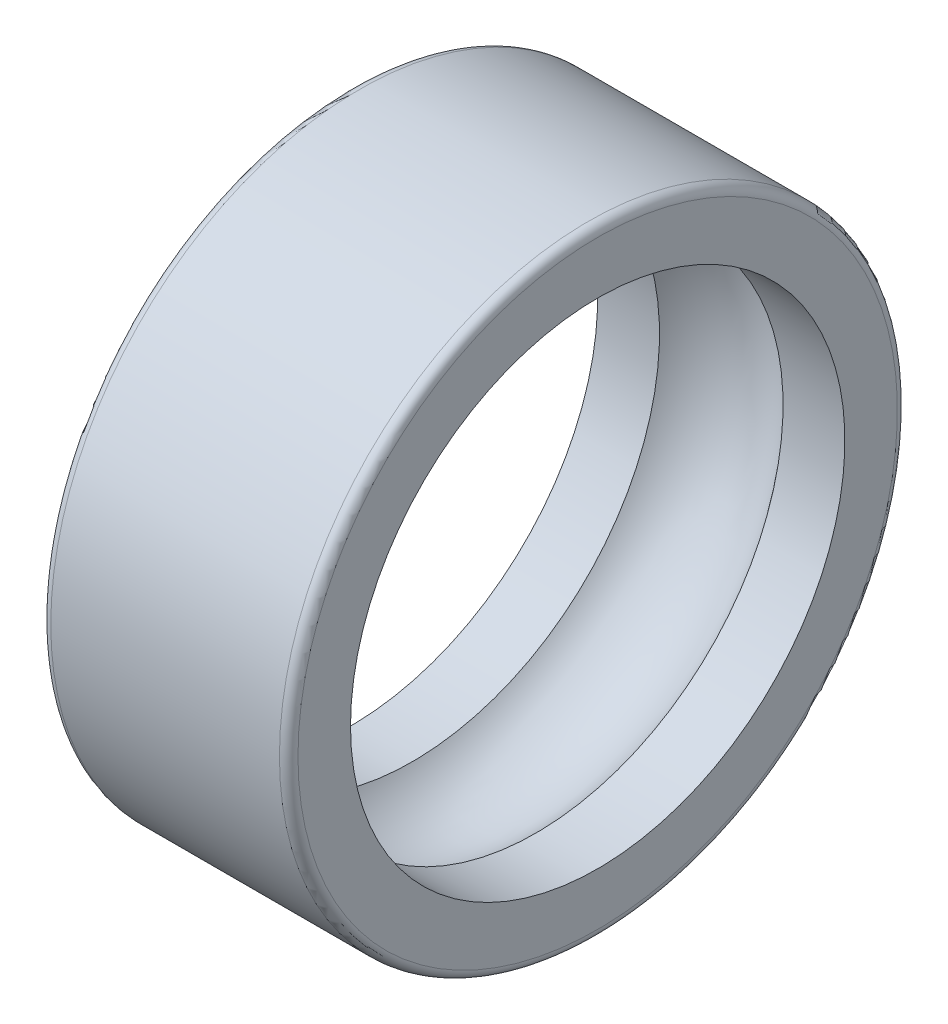
ISO-10303-21;
HEADER;
FILE_DESCRIPTION(('STEP AP214'),'2;1');
FILE_NAME('part.step','',(''),(''),'','','');
FILE_SCHEMA(('AUTOMOTIVE_DESIGN { 1 0 10303 214 1 1 1 1 }'));
ENDSEC;
DATA;
#1=APPLICATION_CONTEXT('core data for automotive mechanical design processes');
#2=APPLICATION_PROTOCOL_DEFINITION('international standard','automotive_design',2000,#1);
#3=PRODUCT_CONTEXT('',#1,'mechanical');
#4=PRODUCT('Part','Part','',(#3));
#5=PRODUCT_RELATED_PRODUCT_CATEGORY('part','',(#4));
#6=PRODUCT_DEFINITION_FORMATION('','',#4);
#7=PRODUCT_DEFINITION_CONTEXT('part definition',#1,'design');
#8=PRODUCT_DEFINITION('design','',#6,#7);
#9=PRODUCT_DEFINITION_SHAPE('','',#8);
#10=(LENGTH_UNIT() NAMED_UNIT(*) SI_UNIT(.MILLI.,.METRE.));
#11=(NAMED_UNIT(*) PLANE_ANGLE_UNIT() SI_UNIT($,.RADIAN.));
#12=(NAMED_UNIT(*) SI_UNIT($,.STERADIAN.) SOLID_ANGLE_UNIT());
#13=UNCERTAINTY_MEASURE_WITH_UNIT(LENGTH_MEASURE(1.E-05),#10,'distance_accuracy_value','');
#14=(GEOMETRIC_REPRESENTATION_CONTEXT(3) GLOBAL_UNCERTAINTY_ASSIGNED_CONTEXT((#13)) GLOBAL_UNIT_ASSIGNED_CONTEXT((#10,
#11,#12)) REPRESENTATION_CONTEXT('',''));
#15=CARTESIAN_POINT('',(0.,0.,0.));
#16=DIRECTION('',(0.,0.,1.));
#17=DIRECTION('',(1.,0.,0.));
#18=AXIS2_PLACEMENT_3D('',#15,#16,#17);
#19=CARTESIAN_POINT('',(0.,4.,0.));
#20=DIRECTION('',(1.,0.,0.));
#21=DIRECTION('',(0.,0.,-1.));
#22=AXIS2_PLACEMENT_3D('',#19,#20,#21);
#23=PLANE('',#22);
#24=CARTESIAN_POINT('',(0.,0.,0.));
#25=DIRECTION('',(1.,0.,0.));
#26=DIRECTION('',(0.,0.,-1.));
#27=AXIS2_PLACEMENT_3D('',#24,#25,#26);
#28=CIRCLE('',#27,4.85);
#29=CARTESIAN_POINT('',(0.,0.,-4.85));
#30=VERTEX_POINT('',#29);
#31=EDGE_CURVE('E43',#30,#30,#28,.F.);
#32=ORIENTED_EDGE('',*,*,#31,.T.);
#33=EDGE_LOOP('',(#32));
#34=FACE_BOUND('',#33,.T.);
#35=CARTESIAN_POINT('',(0.,0.,0.));
#36=DIRECTION('',(-1.,0.,0.));
#37=DIRECTION('',(0.,0.,1.));
#38=AXIS2_PLACEMENT_3D('',#35,#36,#37);
#39=CIRCLE('',#38,4.);
#40=CARTESIAN_POINT('',(0.,0.,4.));
#41=VERTEX_POINT('',#40);
#42=EDGE_CURVE('E48',#41,#41,#39,.T.);
#43=ORIENTED_EDGE('',*,*,#42,.F.);
#44=EDGE_LOOP('',(#43));
#45=FACE_BOUND('',#44,.T.);
#46=ADVANCED_FACE('F29',(#34,#45),#23,.F.);
#47=CARTESIAN_POINT('',(0.,0.,0.));
#48=DIRECTION('',(-1.,0.,0.));
#49=DIRECTION('',(0.,0.,1.));
#50=AXIS2_PLACEMENT_3D('',#47,#48,#49);
#51=CYLINDRICAL_SURFACE('',#50,4.);
#52=CARTESIAN_POINT('',(1.,0.,0.));
#53=DIRECTION('',(-1.,0.,0.));
#54=DIRECTION('',(0.,0.,1.));
#55=AXIS2_PLACEMENT_3D('',#52,#53,#54);
#56=CIRCLE('',#55,4.);
#57=CARTESIAN_POINT('',(1.,0.,4.));
#58=VERTEX_POINT('',#57);
#59=EDGE_CURVE('E51',#58,#58,#56,.T.);
#60=ORIENTED_EDGE('',*,*,#59,.F.);
#61=EDGE_LOOP('',(#60));
#62=FACE_BOUND('',#61,.T.);
#63=ORIENTED_EDGE('',*,*,#42,.T.);
#64=EDGE_LOOP('',(#63));
#65=FACE_BOUND('',#64,.T.);
#66=ADVANCED_FACE('F72',(#62,#65),#51,.F.);
#67=CARTESIAN_POINT('',(2.,0.,0.));
#68=DIRECTION('',(-1.,0.,0.));
#69=DIRECTION('',(0.,0.,1.));
#70=AXIS2_PLACEMENT_3D('',#67,#68,#69);
#71=TOROIDAL_SURFACE('',#70,3.25,1.25);
#72=CARTESIAN_POINT('',(3.,0.,0.));
#73=DIRECTION('',(-1.,0.,0.));
#74=DIRECTION('',(0.,0.,1.));
#75=AXIS2_PLACEMENT_3D('',#72,#73,#74);
#76=CIRCLE('',#75,4.);
#77=CARTESIAN_POINT('',(3.,0.,4.));
#78=VERTEX_POINT('',#77);
#79=EDGE_CURVE('E54',#78,#78,#76,.T.);
#80=ORIENTED_EDGE('',*,*,#79,.F.);
#81=EDGE_LOOP('',(#80));
#82=FACE_BOUND('',#81,.T.);
#83=ORIENTED_EDGE('',*,*,#59,.T.);
#84=EDGE_LOOP('',(#83));
#85=FACE_BOUND('',#84,.T.);
#86=ADVANCED_FACE('F66',(#82,#85),#71,.F.);
#87=CARTESIAN_POINT('',(0.,0.,0.));
#88=DIRECTION('',(-1.,0.,0.));
#89=DIRECTION('',(0.,0.,1.));
#90=AXIS2_PLACEMENT_3D('',#87,#88,#89);
#91=CYLINDRICAL_SURFACE('',#90,4.);
#92=CARTESIAN_POINT('',(4.,0.,0.));
#93=DIRECTION('',(-1.,0.,0.));
#94=DIRECTION('',(0.,0.,1.));
#95=AXIS2_PLACEMENT_3D('',#92,#93,#94);
#96=CIRCLE('',#95,4.);
#97=CARTESIAN_POINT('',(4.,0.,4.));
#98=VERTEX_POINT('',#97);
#99=EDGE_CURVE('E57',#98,#98,#96,.T.);
#100=ORIENTED_EDGE('',*,*,#99,.F.);
#101=EDGE_LOOP('',(#100));
#102=FACE_BOUND('',#101,.T.);
#103=ORIENTED_EDGE('',*,*,#79,.T.);
#104=EDGE_LOOP('',(#103));
#105=FACE_BOUND('',#104,.T.);
#106=ADVANCED_FACE('F63',(#102,#105),#91,.F.);
#107=CARTESIAN_POINT('',(4.,4.,0.));
#108=DIRECTION('',(-1.,0.,0.));
#109=DIRECTION('',(0.,0.,1.));
#110=AXIS2_PLACEMENT_3D('',#107,#108,#109);
#111=PLANE('',#110);
#112=CARTESIAN_POINT('',(4.,0.,0.));
#113=DIRECTION('',(-1.,0.,0.));
#114=DIRECTION('',(0.,0.,1.));
#115=AXIS2_PLACEMENT_3D('',#112,#113,#114);
#116=CIRCLE('',#115,4.85);
#117=CARTESIAN_POINT('',(4.,0.,4.85));
#118=VERTEX_POINT('',#117);
#119=EDGE_CURVE('E10',#118,#118,#116,.F.);
#120=ORIENTED_EDGE('',*,*,#119,.T.);
#121=EDGE_LOOP('',(#120));
#122=FACE_BOUND('',#121,.T.);
#123=ORIENTED_EDGE('',*,*,#99,.T.);
#124=EDGE_LOOP('',(#123));
#125=FACE_BOUND('',#124,.T.);
#126=ADVANCED_FACE('F61',(#122,#125),#111,.F.);
#127=CARTESIAN_POINT('',(0.,0.,0.));
#128=DIRECTION('',(-1.,0.,0.));
#129=DIRECTION('',(0.,0.,1.));
#130=AXIS2_PLACEMENT_3D('',#127,#128,#129);
#131=CYLINDRICAL_SURFACE('',#130,5.);
#132=CARTESIAN_POINT('',(0.15,0.,0.));
#133=DIRECTION('',(1.,0.,0.));
#134=DIRECTION('',(0.,0.,-1.));
#135=AXIS2_PLACEMENT_3D('',#132,#133,#134);
#136=CIRCLE('',#135,5.);
#137=CARTESIAN_POINT('',(0.15,0.,-5.));
#138=VERTEX_POINT('',#137);
#139=EDGE_CURVE('E35',#138,#138,#136,.T.);
#140=ORIENTED_EDGE('',*,*,#139,.T.);
#141=EDGE_LOOP('',(#140));
#142=FACE_BOUND('',#141,.T.);
#143=CARTESIAN_POINT('',(3.85,0.,0.));
#144=DIRECTION('',(-1.,0.,0.));
#145=DIRECTION('',(0.,0.,1.));
#146=AXIS2_PLACEMENT_3D('',#143,#144,#145);
#147=CIRCLE('',#146,5.);
#148=CARTESIAN_POINT('',(3.85,0.,5.));
#149=VERTEX_POINT('',#148);
#150=EDGE_CURVE('E39',#149,#149,#147,.T.);
#151=ORIENTED_EDGE('',*,*,#150,.T.);
#152=EDGE_LOOP('',(#151));
#153=FACE_BOUND('',#152,.T.);
#154=ADVANCED_FACE('F89',(#142,#153),#131,.T.);
#155=CARTESIAN_POINT('',(0.15,0.,0.));
#156=DIRECTION('',(1.,0.,0.));
#157=DIRECTION('',(0.,0.,-1.));
#158=AXIS2_PLACEMENT_3D('',#155,#156,#157);
#159=TOROIDAL_SURFACE('',#158,4.85,0.15);
#160=ORIENTED_EDGE('',*,*,#139,.F.);
#161=EDGE_LOOP('',(#160));
#162=FACE_BOUND('',#161,.T.);
#163=ORIENTED_EDGE('',*,*,#31,.F.);
#164=EDGE_LOOP('',(#163));
#165=FACE_BOUND('',#164,.T.);
#166=ADVANCED_FACE('F86',(#162,#165),#159,.T.);
#167=CARTESIAN_POINT('',(3.85,0.,0.));
#168=DIRECTION('',(-1.,0.,0.));
#169=DIRECTION('',(0.,0.,1.));
#170=AXIS2_PLACEMENT_3D('',#167,#168,#169);
#171=TOROIDAL_SURFACE('',#170,4.85,0.15);
#172=ORIENTED_EDGE('',*,*,#119,.F.);
#173=EDGE_LOOP('',(#172));
#174=FACE_BOUND('',#173,.T.);
#175=ORIENTED_EDGE('',*,*,#150,.F.);
#176=EDGE_LOOP('',(#175));
#177=FACE_BOUND('',#176,.T.);
#178=ADVANCED_FACE('F88',(#174,#177),#171,.T.);
#179=CLOSED_SHELL('',(#46,#66,#86,#106,#126,#154,#166,#178));
#180=MANIFOLD_SOLID_BREP('B2',#179);
#181=ADVANCED_BREP_SHAPE_REPRESENTATION('',(#18,#180),#14);
#182=SHAPE_DEFINITION_REPRESENTATION(#9,#181);
ENDSEC;
END-ISO-10303-21;
